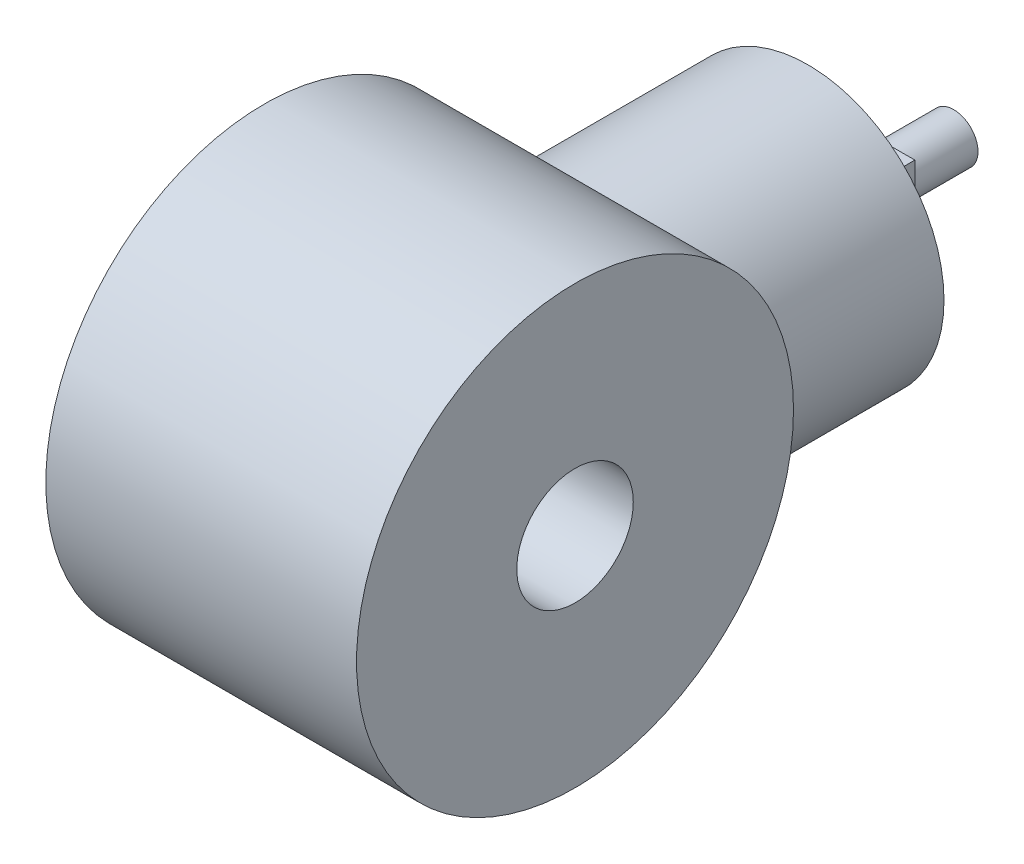
ISO-10303-21;
HEADER;
FILE_DESCRIPTION(('STEP AP214'),'2;1');
FILE_NAME('part.step','',(''),(''),'','','');
FILE_SCHEMA(('AUTOMOTIVE_DESIGN { 1 0 10303 214 1 1 1 1 }'));
ENDSEC;
DATA;
#1=APPLICATION_CONTEXT('core data for automotive mechanical design processes');
#2=APPLICATION_PROTOCOL_DEFINITION('international standard','automotive_design',2000,#1);
#3=PRODUCT_CONTEXT('',#1,'mechanical');
#4=PRODUCT('Part','Part','',(#3));
#5=PRODUCT_RELATED_PRODUCT_CATEGORY('part','',(#4));
#6=PRODUCT_DEFINITION_FORMATION('','',#4);
#7=PRODUCT_DEFINITION_CONTEXT('part definition',#1,'design');
#8=PRODUCT_DEFINITION('design','',#6,#7);
#9=PRODUCT_DEFINITION_SHAPE('','',#8);
#10=(LENGTH_UNIT() NAMED_UNIT(*) SI_UNIT(.MILLI.,.METRE.));
#11=(NAMED_UNIT(*) PLANE_ANGLE_UNIT() SI_UNIT($,.RADIAN.));
#12=(NAMED_UNIT(*) SI_UNIT($,.STERADIAN.) SOLID_ANGLE_UNIT());
#13=UNCERTAINTY_MEASURE_WITH_UNIT(LENGTH_MEASURE(1.E-05),#10,'distance_accuracy_value','');
#14=(GEOMETRIC_REPRESENTATION_CONTEXT(3) GLOBAL_UNCERTAINTY_ASSIGNED_CONTEXT((#13)) GLOBAL_UNIT_ASSIGNED_CONTEXT((#10,
#11,#12)) REPRESENTATION_CONTEXT('',''));
#15=CARTESIAN_POINT('',(0.,0.,0.));
#16=DIRECTION('',(0.,0.,1.));
#17=DIRECTION('',(1.,0.,0.));
#18=AXIS2_PLACEMENT_3D('',#15,#16,#17);
#19=CARTESIAN_POINT('',(0.,0.,-40.));
#20=DIRECTION('',(0.,0.,1.));
#21=DIRECTION('',(1.,0.,0.));
#22=AXIS2_PLACEMENT_3D('',#19,#20,#21);
#23=PLANE('',#22);
#24=CARTESIAN_POINT('',(0.,0.,-40.));
#25=DIRECTION('',(0.,0.,1.));
#26=DIRECTION('',(1.,0.,0.));
#27=AXIS2_PLACEMENT_3D('',#24,#25,#26);
#28=CIRCLE('',#27,14.);
#29=CARTESIAN_POINT('',(14.,0.,-40.));
#30=VERTEX_POINT('',#29);
#31=EDGE_CURVE('E105',#30,#30,#28,.T.);
#32=ORIENTED_EDGE('',*,*,#31,.F.);
#33=EDGE_LOOP('',(#32));
#34=FACE_BOUND('',#33,.T.);
#35=DIRECTION('',(0.,1.,0.));
#36=VECTOR('',#35,1.);
#37=CARTESIAN_POINT('',(-6.,-6.,-40.));
#38=LINE('',#37,#36);
#39=CARTESIAN_POINT('',(-6.,-6.,-40.));
#40=VERTEX_POINT('',#39);
#41=CARTESIAN_POINT('',(-6.,6.,-40.));
#42=VERTEX_POINT('',#41);
#43=EDGE_CURVE('E101',#40,#42,#38,.T.);
#44=ORIENTED_EDGE('',*,*,#43,.F.);
#45=DIRECTION('',(-1.,0.,0.));
#46=VECTOR('',#45,1.);
#47=CARTESIAN_POINT('',(6.,-6.,-40.));
#48=LINE('',#47,#46);
#49=CARTESIAN_POINT('',(6.,-6.,-40.));
#50=VERTEX_POINT('',#49);
#51=EDGE_CURVE('E98',#50,#40,#48,.T.);
#52=ORIENTED_EDGE('',*,*,#51,.F.);
#53=DIRECTION('',(0.,-1.,0.));
#54=VECTOR('',#53,1.);
#55=CARTESIAN_POINT('',(6.,-6.,-40.));
#56=LINE('',#55,#54);
#57=CARTESIAN_POINT('',(6.,6.,-40.));
#58=VERTEX_POINT('',#57);
#59=EDGE_CURVE('E60',#58,#50,#56,.T.);
#60=ORIENTED_EDGE('',*,*,#59,.F.);
#61=DIRECTION('',(1.,0.,0.));
#62=VECTOR('',#61,1.);
#63=CARTESIAN_POINT('',(6.,6.,-40.));
#64=LINE('',#63,#62);
#65=EDGE_CURVE('E55',#42,#58,#64,.T.);
#66=ORIENTED_EDGE('',*,*,#65,.F.);
#67=EDGE_LOOP('',(#44,#52,#60,#66));
#68=FACE_BOUND('',#67,.T.);
#69=ADVANCED_FACE('F39',(#34,#68),#23,.F.);
#70=CARTESIAN_POINT('',(16.,0.,0.));
#71=DIRECTION('',(1.,0.,0.));
#72=DIRECTION('',(0.,0.,-1.));
#73=AXIS2_PLACEMENT_3D('',#70,#71,#72);
#74=PLANE('',#73);
#75=CARTESIAN_POINT('',(16.,0.,0.));
#76=DIRECTION('',(1.,0.,0.));
#77=DIRECTION('',(0.,0.,-1.));
#78=AXIS2_PLACEMENT_3D('',#75,#76,#77);
#79=CIRCLE('',#78,22.5);
#80=CARTESIAN_POINT('',(16.,0.,-22.5));
#81=VERTEX_POINT('',#80);
#82=EDGE_CURVE('E48',#81,#81,#79,.T.);
#83=ORIENTED_EDGE('',*,*,#82,.T.);
#84=EDGE_LOOP('',(#83));
#85=FACE_BOUND('',#84,.T.);
#86=CARTESIAN_POINT('',(16.,0.,0.));
#87=DIRECTION('',(1.,0.,0.));
#88=DIRECTION('',(0.,0.,-1.));
#89=AXIS2_PLACEMENT_3D('',#86,#87,#88);
#90=CIRCLE('',#89,6.);
#91=CARTESIAN_POINT('',(16.,0.,-6.));
#92=VERTEX_POINT('',#91);
#93=EDGE_CURVE('E121',#92,#92,#90,.T.);
#94=ORIENTED_EDGE('',*,*,#93,.F.);
#95=EDGE_LOOP('',(#94));
#96=FACE_BOUND('',#95,.T.);
#97=ADVANCED_FACE('F134',(#85,#96),#74,.T.);
#98=CARTESIAN_POINT('',(-16.,0.,0.));
#99=DIRECTION('',(1.,0.,0.));
#100=DIRECTION('',(0.,0.,-1.));
#101=AXIS2_PLACEMENT_3D('',#98,#99,#100);
#102=PLANE('',#101);
#103=CARTESIAN_POINT('',(-16.,0.,0.));
#104=DIRECTION('',(1.,0.,0.));
#105=DIRECTION('',(0.,0.,-1.));
#106=AXIS2_PLACEMENT_3D('',#103,#104,#105);
#107=CIRCLE('',#106,22.5);
#108=CARTESIAN_POINT('',(-16.,0.,-22.5));
#109=VERTEX_POINT('',#108);
#110=EDGE_CURVE('E279',#109,#109,#107,.T.);
#111=ORIENTED_EDGE('',*,*,#110,.F.);
#112=EDGE_LOOP('',(#111));
#113=FACE_BOUND('',#112,.T.);
#114=CARTESIAN_POINT('',(-16.,0.,0.));
#115=DIRECTION('',(1.,0.,0.));
#116=DIRECTION('',(0.,0.,-1.));
#117=AXIS2_PLACEMENT_3D('',#114,#115,#116);
#118=CIRCLE('',#117,6.);
#119=CARTESIAN_POINT('',(-16.,0.,-6.));
#120=VERTEX_POINT('',#119);
#121=EDGE_CURVE('E120',#120,#120,#118,.T.);
#122=ORIENTED_EDGE('',*,*,#121,.T.);
#123=EDGE_LOOP('',(#122));
#124=FACE_BOUND('',#123,.T.);
#125=ADVANCED_FACE('F136',(#113,#124),#102,.F.);
#126=CARTESIAN_POINT('',(16.,0.,0.));
#127=DIRECTION('',(-1.,0.,0.));
#128=DIRECTION('',(0.,0.,1.));
#129=AXIS2_PLACEMENT_3D('',#126,#127,#128);
#130=CYLINDRICAL_SURFACE('',#129,22.5);
#131=ORIENTED_EDGE('',*,*,#110,.T.);
#132=EDGE_LOOP('',(#131));
#133=FACE_BOUND('',#132,.T.);
#134=CARTESIAN_POINT('',(14.,0.,-22.5));
#135=CARTESIAN_POINT('',(13.9999991063449,0.356097070760692,-22.4999990143699));
#136=CARTESIAN_POINT('',(13.9863954765435,0.712218350277575,-22.4915272958149));
#137=CARTESIAN_POINT('',(13.9321685824194,1.42174063001494,-22.4578466611244));
#138=CARTESIAN_POINT('',(13.8915331197188,1.77514032923202,-22.4326301887648));
#139=CARTESIAN_POINT('',(13.7837231030717,2.47694073666973,-22.3660283513862));
#140=CARTESIAN_POINT('',(13.7165027734724,2.82533174256533,-22.3246150990087));
#141=CARTESIAN_POINT('',(13.5564441244614,3.51394010054276,-22.2266321618331));
#142=CARTESIAN_POINT('',(13.4636083824175,3.85415827121584,-22.1700640019058));
#143=CARTESIAN_POINT('',(13.2539894629711,4.52259338441289,-22.0433958764243));
#144=CARTESIAN_POINT('',(13.1373281147551,4.85086174847136,-21.9733648543906));
#145=CARTESIAN_POINT('',(12.8810427155204,5.49536361825578,-21.8211053520407));
#146=CARTESIAN_POINT('',(12.7414181701369,5.81159686470234,-21.7388766091287));
#147=CARTESIAN_POINT('',(12.4405700102356,6.43044019166893,-21.5639238631528));
#148=CARTESIAN_POINT('',(12.2793531031596,6.73305446393551,-21.4712031207009));
#149=CARTESIAN_POINT('',(11.9365571460911,7.32360555209682,-21.2770168328875));
#150=CARTESIAN_POINT('',(11.7549755696832,7.61154054043849,-21.1755502028841));
#151=CARTESIAN_POINT('',(11.3574765199916,8.19400545558421,-20.9573974599138));
#152=CARTESIAN_POINT('',(11.1399774171205,8.48724295592487,-20.8401426208988));
#153=CARTESIAN_POINT('',(10.6840341744648,9.05449350465572,-20.600024873324));
#154=CARTESIAN_POINT('',(10.445589107087,9.32850570068461,-20.4771617165154));
#155=CARTESIAN_POINT('',(9.94862465188903,9.85680235955472,-20.2281690739126));
#156=CARTESIAN_POINT('',(9.69008020116802,10.111061375416,-20.1020356451637));
#157=CARTESIAN_POINT('',(9.1542032090265,10.5986702200811,-19.8492724340888));
#158=CARTESIAN_POINT('',(8.8768701184529,10.8320194372713,-19.722642637357));
#159=CARTESIAN_POINT('',(8.2658596247561,11.3068419436011,-19.4547996495074));
#160=CARTESIAN_POINT('',(7.92961458355073,11.545205662179,-19.3139089577244));
#161=CARTESIAN_POINT('',(7.23522428056692,11.9925865501106,-19.0393482416016));
#162=CARTESIAN_POINT('',(6.877074990088,12.2015982975125,-18.9056795541225));
#163=CARTESIAN_POINT('',(6.14073545483857,12.5882506642244,-18.6504569420656));
#164=CARTESIAN_POINT('',(5.76257305179082,12.7659334496767,-18.528886831374));
#165=CARTESIAN_POINT('',(4.98756561364782,13.0881671689531,-18.3026958276451));
#166=CARTESIAN_POINT('',(4.59072830652404,13.2327316648236,-18.1980680018518));
#167=CARTESIAN_POINT('',(3.88513918827318,13.4538110619401,-18.0349292211783));
#168=CARTESIAN_POINT('',(3.57999709901742,13.5382643592609,-17.9714792470539));
#169=CARTESIAN_POINT('',(2.96224320580907,13.6867074831745,-17.8586883245612));
#170=CARTESIAN_POINT('',(2.64963321704918,13.7507022292345,-17.8093439846518));
#171=CARTESIAN_POINT('',(2.01907360660311,13.8573251676281,-17.7265086605148));
#172=CARTESIAN_POINT('',(1.70113056156642,13.8999779261594,-17.6929994513684));
#173=CARTESIAN_POINT('',(1.06171502205683,13.9633794501665,-17.6430064881633));
#174=CARTESIAN_POINT('',(0.74024247772128,13.9841279057882,-17.6265229749471));
#175=CARTESIAN_POINT('',(0.0953808872242142,14.0034002854199,-17.6112162512838));
#176=CARTESIAN_POINT('',(-0.22801095870823,14.0018671514822,-17.6124383808281));
#177=CARTESIAN_POINT('',(-0.873354428547939,13.97646364726,-17.6326039054413));
#178=CARTESIAN_POINT('',(-1.1953060450018,13.9525931615104,-17.6515473921147));
#179=CARTESIAN_POINT('',(-1.83556301177623,13.8828847906998,-17.7064243703099));
#180=CARTESIAN_POINT('',(-2.15386570296615,13.8370318135284,-17.7423695341295));
#181=CARTESIAN_POINT('',(-2.78446216526763,13.7240443241488,-17.8299101531281));
#182=CARTESIAN_POINT('',(-3.0967558034086,13.6569093415775,-17.8815059542076));
#183=CARTESIAN_POINT('',(-3.70676991729286,13.5039464211317,-17.9972888935506));
#184=CARTESIAN_POINT('',(-4.00465984733719,13.4185620879421,-18.0611741417939));
#185=CARTESIAN_POINT('',(-4.59179982140109,13.2291560354186,-18.2003635920619));
#186=CARTESIAN_POINT('',(-4.88104701592402,13.1251282467728,-18.2756715114669));
#187=CARTESIAN_POINT('',(-5.44983142456798,12.8993400599701,-18.4357306593898));
#188=CARTESIAN_POINT('',(-5.72936822981811,12.7775789162412,-18.5204822849188));
#189=CARTESIAN_POINT('',(-6.27798380238452,12.517153681204,-18.6974771275311));
#190=CARTESIAN_POINT('',(-6.54706205932532,12.3784887663568,-18.7897207095436));
#191=CARTESIAN_POINT('',(-7.12315036574906,12.0577227084505,-18.997481055651));
#192=CARTESIAN_POINT('',(-7.42792424344296,11.8723373870692,-19.1141384855461));
#193=CARTESIAN_POINT('',(-8.02107596986107,11.4799300062105,-19.3523613239283));
#194=CARTESIAN_POINT('',(-8.30945609304615,11.2729109595519,-19.4739260475583));
#195=CARTESIAN_POINT('',(-8.86940709190691,10.8378705685859,-19.7193557781036));
#196=CARTESIAN_POINT('',(-9.14096035407191,10.6098278185812,-19.8432230246409));
#197=CARTESIAN_POINT('',(-9.66610969518611,10.1337040929321,-20.0905456910712));
#198=CARTESIAN_POINT('',(-9.9197046294846,9.88562184213811,-20.2140010842358));
#199=CARTESIAN_POINT('',(-10.4476162402387,9.3283197696847,-20.4778479284996));
#200=CARTESIAN_POINT('',(-10.7186212696107,9.01571048102724,-20.6177380925806));
#201=CARTESIAN_POINT('',(-11.2333493529561,8.36562967979878,-20.8899601598757));
#202=CARTESIAN_POINT('',(-11.4770692023033,8.02815525453592,-21.0222911743807));
#203=CARTESIAN_POINT('',(-11.9350888320568,7.3299323932841,-21.2758074096155));
#204=CARTESIAN_POINT('',(-12.1493958865148,6.96918974429673,-21.3969953836647));
#205=CARTESIAN_POINT('',(-12.5463308451294,6.22630498724362,-21.6248469618756));
#206=CARTESIAN_POINT('',(-12.7289625365012,5.84416544470126,-21.7315123020849));
#207=CARTESIAN_POINT('',(-13.0509942907445,5.08260793859719,-21.9217363589385));
#208=CARTESIAN_POINT('',(-13.1922230753291,4.70420212464339,-22.0062449689521));
#209=CARTESIAN_POINT('',(-13.442236496525,3.93324908027808,-22.1570252528652));
#210=CARTESIAN_POINT('',(-13.5510217780177,3.54070213112461,-22.2232972892522));
#211=CARTESIAN_POINT('',(-13.7342547837559,2.74528889528994,-22.3354988912287));
#212=CARTESIAN_POINT('',(-13.8087421267131,2.34243508535216,-22.3814519255366));
#213=CARTESIAN_POINT('',(-13.9221968391314,1.52990582154782,-22.4516271114232));
#214=CARTESIAN_POINT('',(-13.961170148282,1.12023152007733,-22.4758528968536));
#215=CARTESIAN_POINT('',(-13.9997998195308,0.358889373676653,-22.4998719272296));
#216=CARTESIAN_POINT('',(-14.0043982827077,0.00755774378719101,-22.5027361711104));
#217=CARTESIAN_POINT('',(-13.9871816996814,-0.69417998235557,-22.4920251896602));
#218=CARTESIAN_POINT('',(-13.9653697696335,-1.04458618291156,-22.4784519037889));
#219=CARTESIAN_POINT('',(-13.8956481416465,-1.74175208722438,-22.4352021344506));
#220=CARTESIAN_POINT('',(-13.8477399746312,-2.08851200367258,-22.4055265956152));
#221=CARTESIAN_POINT('',(-13.7264844114638,-2.77586354777609,-22.3307880770863));
#222=CARTESIAN_POINT('',(-13.653136542784,-3.11645506073326,-22.285724811575));
#223=CARTESIAN_POINT('',(-13.4851559526508,-3.77653035917098,-22.1832184234865));
#224=CARTESIAN_POINT('',(-13.3914243330754,-4.09632676495062,-22.1263027830684));
#225=CARTESIAN_POINT('',(-13.1822823440839,-4.72626431908141,-22.0003545406357));
#226=CARTESIAN_POINT('',(-13.0668728530538,-5.0364058580537,-21.931322429587));
#227=CARTESIAN_POINT('',(-12.8154741779394,-5.64554678099418,-21.782472736762));
#228=CARTESIAN_POINT('',(-12.6794843695837,-5.94454582662948,-21.7026548278234));
#229=CARTESIAN_POINT('',(-12.3880468486983,-6.5301837746921,-21.5336854587996));
#230=CARTESIAN_POINT('',(-12.2325967516374,-6.81682115660849,-21.4445328551239));
#231=CARTESIAN_POINT('',(-11.8866610539475,-7.40508045510371,-21.2490077061142));
#232=CARTESIAN_POINT('',(-11.6942214627053,-7.70527800990255,-21.1418056549229));
#233=CARTESIAN_POINT('',(-11.288463870177,-8.28835118714579,-20.9200990227065));
#234=CARTESIAN_POINT('',(-11.0751447036999,-8.57122584144697,-20.8055940342632));
#235=CARTESIAN_POINT('',(-10.628640705419,-9.11904546917578,-20.5713838782847));
#236=CARTESIAN_POINT('',(-10.3954363746239,-9.38397237592853,-20.4516736642968));
#237=CARTESIAN_POINT('',(-9.91041232281628,-9.89483745973913,-20.2094563165926));
#238=CARTESIAN_POINT('',(-9.65859116539603,-10.1407741685819,-20.0869489675645));
#239=CARTESIAN_POINT('',(-9.09978037256264,-10.646867649964,-19.8238941960109));
#240=CARTESIAN_POINT('',(-8.79006308548143,-10.9039892311197,-19.6832841834239));
#241=CARTESIAN_POINT('',(-8.14864949782422,-11.3913021109329,-19.4053328807151));
#242=CARTESIAN_POINT('',(-7.81694950469237,-11.621488867149,-19.2679921450446));
#243=CARTESIAN_POINT('',(-7.13300281471241,-12.0533696487139,-19.0008081273582));
#244=CARTESIAN_POINT('',(-6.78077239104192,-12.25508581837,-18.8709590653482));
#245=CARTESIAN_POINT('',(-6.05666117524255,-12.6286498218822,-18.623036461906));
#246=CARTESIAN_POINT('',(-5.68477664643218,-12.8004919491879,-18.5049651721));
#247=CARTESIAN_POINT('',(-5.0034855779446,-13.0793953783023,-18.308524713068));
#248=CARTESIAN_POINT('',(-4.69743443018148,-13.1924763545354,-18.2270330766376));
#249=CARTESIAN_POINT('',(-4.07550371447287,-13.3976638555018,-18.076746941565));
#250=CARTESIAN_POINT('',(-3.75963018923896,-13.489782996707,-18.0079448101369));
#251=CARTESIAN_POINT('',(-3.11976359885008,-13.6519549960383,-17.8853144274028));
#252=CARTESIAN_POINT('',(-2.79577966995472,-13.7220315751265,-17.8314700867102));
#253=CARTESIAN_POINT('',(-2.14132899837133,-13.8392629880396,-17.7406403655119));
#254=CARTESIAN_POINT('',(-1.8108622695535,-13.8864178709009,-17.7036549489399));
#255=CARTESIAN_POINT('',(-1.14399970642003,-13.9572312071607,-17.6478825891211));
#256=CARTESIAN_POINT('',(-0.807581108722389,-13.9807574190091,-17.6291980840485));
#257=CARTESIAN_POINT('',(-0.133399167373299,-14.0034266162649,-17.6111969753959));
#258=CARTESIAN_POINT('',(0.204364171637468,-14.0025696857454,-17.6118803050355));
#259=CARTESIAN_POINT('',(0.878453554406333,-13.9764850836819,-17.6325872637024));
#260=CARTESIAN_POINT('',(1.21477908673595,-13.9512493649163,-17.6526172788985));
#261=CARTESIAN_POINT('',(1.88312198541007,-13.8768481077348,-17.7111635018145));
#262=CARTESIAN_POINT('',(2.21513940191667,-13.8276828482026,-17.749679494092));
#263=CARTESIAN_POINT('',(2.847096430935,-13.7109159899639,-17.8400046209491));
#264=CARTESIAN_POINT('',(3.14753630822845,-13.6450271196387,-17.8905606177838));
#265=CARTESIAN_POINT('',(3.74122938906233,-13.4943337274358,-18.0044960451393));
#266=CARTESIAN_POINT('',(4.03448025553805,-13.4095231425079,-18.0678795853599));
#267=CARTESIAN_POINT('',(4.61251008112275,-13.221841038016,-18.2056705838513));
#268=CARTESIAN_POINT('',(4.89728822823095,-13.1189677938579,-18.2800790946628));
#269=CARTESIAN_POINT('',(5.45734443068171,-12.8960582969548,-18.4380147760727));
#270=CARTESIAN_POINT('',(5.73262212749024,-12.7760213973541,-18.5215422903159));
#271=CARTESIAN_POINT('',(6.62221127308823,-12.3537800104942,-18.8085087023368));
#272=CARTESIAN_POINT('',(7.21544987836899,-12.0164484645334,-19.0275484110721));
#273=CARTESIAN_POINT('',(8.06010022417248,-11.4520694849974,-19.3687576085944));
#274=CARTESIAN_POINT('',(8.3342878987445,-11.2540573187376,-19.4846859677146));
#275=CARTESIAN_POINT('',(8.8672219656207,-10.8391103665342,-19.7185274416532));
#276=CARTESIAN_POINT('',(9.12596723722914,-10.6221742100325,-19.8364406997267));
#277=CARTESIAN_POINT('',(9.67595262090818,-10.1261301722912,-20.0948793656167));
#278=CARTESIAN_POINT('',(9.96372478000989,-9.84313657480139,-20.2353422163846));
#279=CARTESIAN_POINT('',(10.514689399335,-9.25227001166964,-20.5122398874249));
#280=CARTESIAN_POINT('',(10.777878683044,-8.94439384034817,-20.6486741855883));
#281=CARTESIAN_POINT('',(11.2781830421511,-8.30466819647365,-20.9141680993678));
#282=CARTESIAN_POINT('',(11.5152802518571,-7.97280255237931,-21.0432226332422));
#283=CARTESIAN_POINT('',(11.8496380531149,-7.45841218343327,-21.2286445071225));
#284=CARTESIAN_POINT('',(11.9575416277361,-7.28418533088141,-21.2890912173789));
#285=CARTESIAN_POINT('',(12.1660574077229,-6.93031323868878,-21.4069042672453));
#286=CARTESIAN_POINT('',(12.2666668861796,-6.75066600781436,-21.4642694527674));
#287=CARTESIAN_POINT('',(12.5566431024792,-6.20485018192081,-21.6308630806129));
#288=CARTESIAN_POINT('',(12.7347014185717,-5.83097261813776,-21.734893555375));
#289=CARTESIAN_POINT('',(13.0581919714671,-5.06520334425359,-21.9259968322529));
#290=CARTESIAN_POINT('',(13.2036300302365,-4.67331486375515,-22.0130726600171));
#291=CARTESIAN_POINT('',(13.3954748988431,-4.07492554203531,-22.1288541727767));
#292=CARTESIAN_POINT('',(13.4549795158029,-3.87396203641952,-22.1649399126865));
#293=CARTESIAN_POINT('',(13.5650774576718,-3.4688249782404,-22.2319460011667));
#294=CARTESIAN_POINT('',(13.6156730985371,-3.26465227501011,-22.2628676920629));
#295=CARTESIAN_POINT('',(13.7536968188771,-2.64818147624363,-22.3474561898602));
#296=CARTESIAN_POINT('',(13.8274827573131,-2.23155423681448,-22.3930199664094));
#297=CARTESIAN_POINT('',(13.9213973375204,-1.51200587963175,-22.4511563186984));
#298=CARTESIAN_POINT('',(13.9508414460303,-1.2106965137664,-22.4694403922936));
#299=CARTESIAN_POINT('',(13.9901437623131,-0.606264020431728,-22.493863027433));
#300=CARTESIAN_POINT('',(14.0000007607569,-0.303140782130812,-22.500000839054));
#301=CARTESIAN_POINT('',(14.,0.,-22.5));
#302=B_SPLINE_CURVE_WITH_KNOTS('',3,(#134,#135,#136,#137,#138,#139,#140,#141,#142,#143,#144,
#145,#146,#147,#148,#149,#150,#151,#152,#153,#154,#155,#156,#157,#158,#159,#160,#161,#162,#163,
#164,#165,#166,#167,#168,#169,#170,#171,#172,#173,#174,#175,#176,#177,#178,#179,#180,#181,#182,
#183,#184,#185,#186,#187,#188,#189,#190,#191,#192,#193,#194,#195,#196,#197,#198,#199,#200,#201,
#202,#203,#204,#205,#206,#207,#208,#209,#210,#211,#212,#213,#214,#215,#216,#217,#218,#219,#220,
#221,#222,#223,#224,#225,#226,#227,#228,#229,#230,#231,#232,#233,#234,#235,#236,#237,#238,#239,
#240,#241,#242,#243,#244,#245,#246,#247,#248,#249,#250,#251,#252,#253,#254,#255,#256,#257,#258,
#259,#260,#261,#262,#263,#264,#265,#266,#267,#268,#269,#270,#271,#272,#273,#274,#275,#276,#277,
#278,#279,#280,#281,#282,#283,#284,#285,#286,#287,#288,#289,#290,#291,#292,#293,#294,#295,#296,
#297,#298,#299,#300,#301),.UNSPECIFIED.,.T.,.F.,(4,2,2,2,2,2,2,2,2,2,2,2,2,2,2,2,2,2,2,2,2,2,2,
2,2,2,2,2,2,2,2,2,2,2,2,2,2,2,2,2,2,2,2,2,2,2,2,2,2,2,2,2,2,2,2,2,2,2,2,2,2,2,2,2,2,2,2,2,2,2,2,
2,2,2,2,2,2,2,2,2,2,2,2,4),(0.,1.0679758240011,2.13643390971613,3.20673980634869,
4.27693805034709,5.34179515043565,6.40667517837594,7.47122517637423,8.53590738751166,
9.68514764063392,10.8344388136121,11.9851868179432,13.1359684707804,14.4411277016062,
15.7465277076779,17.050157116286,18.3532517263712,19.3210355800973,20.2885865449823,
21.2550212106111,22.2214695470601,23.1903931671192,24.1593217957176,25.1289165983471,
26.0985328319181,27.0468234955661,27.9954234345664,28.9440632675324,29.8927493359957,
31.0176229184045,32.1423400536389,33.2682152625584,34.3941621694695,35.7027545883913,
37.0115005397421,38.319922240839,39.6281873945368,40.8643030963197,42.1003942261178,
43.3350539008242,44.5695070419136,45.6222879649376,46.6749446827224,47.7275396535305,
48.7801541767215,49.7933045186599,50.8064138166712,51.8195538519125,52.8328181521628,
53.9487475505038,55.0647392591575,56.1818381561973,57.299023334728,58.576749957317,
59.8546917533394,61.1316340282376,62.4088199577247,63.4167689572916,64.4241096801529,
65.4303626213413,66.4366134098462,67.4484649713284,68.46031304395,69.472495232805,
70.4846656255925,71.4188354910979,72.3533051219358,73.2878640230142,74.222458154589,
76.3635260888552,77.4355285185538,78.5076086519192,79.7882052430145,81.0689670801281,
82.3506004909615,82.9914037086746,83.6324452693032,84.9114151721034,86.1901566261963,
86.8279270975521,87.465531530065,88.7395392601873,89.648636993739,90.55779085421),.UNSPECIFIED.);
#303=CARTESIAN_POINT('',(14.,0.,-22.5));
#304=VERTEX_POINT('',#303);
#305=EDGE_CURVE('E113',#304,#304,#302,.T.);
#306=ORIENTED_EDGE('',*,*,#305,.T.);
#307=EDGE_LOOP('',(#306));
#308=FACE_BOUND('',#307,.T.);
#309=ORIENTED_EDGE('',*,*,#82,.F.);
#310=EDGE_LOOP('',(#309));
#311=FACE_BOUND('',#310,.T.);
#312=ADVANCED_FACE('F41',(#133,#308,#311),#130,.T.);
#313=CARTESIAN_POINT('',(16.,0.,0.));
#314=DIRECTION('',(-1.,0.,0.));
#315=DIRECTION('',(0.,0.,1.));
#316=AXIS2_PLACEMENT_3D('',#313,#314,#315);
#317=CYLINDRICAL_SURFACE('',#316,6.);
#318=ORIENTED_EDGE('',*,*,#93,.T.);
#319=EDGE_LOOP('',(#318));
#320=FACE_BOUND('',#319,.T.);
#321=ORIENTED_EDGE('',*,*,#121,.F.);
#322=EDGE_LOOP('',(#321));
#323=FACE_BOUND('',#322,.T.);
#324=ADVANCED_FACE('F128',(#320,#323),#317,.F.);
#325=CARTESIAN_POINT('',(0.,0.,-40.));
#326=DIRECTION('',(0.,0.,1.));
#327=DIRECTION('',(1.,0.,0.));
#328=AXIS2_PLACEMENT_3D('',#325,#326,#327);
#329=CYLINDRICAL_SURFACE('',#328,14.);
#330=ORIENTED_EDGE('',*,*,#31,.T.);
#331=EDGE_LOOP('',(#330));
#332=FACE_BOUND('',#331,.T.);
#333=ORIENTED_EDGE('',*,*,#305,.F.);
#334=EDGE_LOOP('',(#333));
#335=FACE_BOUND('',#334,.T.);
#336=ADVANCED_FACE('F123',(#332,#335),#329,.T.);
#337=CARTESIAN_POINT('',(-6.,-6.,-45.));
#338=DIRECTION('',(1.,0.,0.));
#339=DIRECTION('',(0.,0.,-1.));
#340=AXIS2_PLACEMENT_3D('',#337,#338,#339);
#341=PLANE('',#340);
#342=ORIENTED_EDGE('',*,*,#43,.T.);
#343=DIRECTION('',(0.,0.,1.));
#344=VECTOR('',#343,1.);
#345=CARTESIAN_POINT('',(-6.,6.,-45.));
#346=LINE('',#345,#344);
#347=CARTESIAN_POINT('',(-6.,6.,-45.));
#348=VERTEX_POINT('',#347);
#349=EDGE_CURVE('E82',#348,#42,#346,.T.);
#350=ORIENTED_EDGE('',*,*,#349,.F.);
#351=DIRECTION('',(0.,1.,0.));
#352=VECTOR('',#351,1.);
#353=CARTESIAN_POINT('',(-6.,-6.,-45.));
#354=LINE('',#353,#352);
#355=CARTESIAN_POINT('',(-6.,-6.,-45.));
#356=VERTEX_POINT('',#355);
#357=EDGE_CURVE('E89',#356,#348,#354,.T.);
#358=ORIENTED_EDGE('',*,*,#357,.F.);
#359=DIRECTION('',(0.,0.,1.));
#360=VECTOR('',#359,1.);
#361=CARTESIAN_POINT('',(-6.,-6.,-45.));
#362=LINE('',#361,#360);
#363=EDGE_CURVE('E158',#356,#40,#362,.T.);
#364=ORIENTED_EDGE('',*,*,#363,.T.);
#365=EDGE_LOOP('',(#342,#350,#358,#364));
#366=FACE_BOUND('',#365,.T.);
#367=ADVANCED_FACE('F100',(#366),#341,.F.);
#368=CARTESIAN_POINT('',(6.,6.,-45.));
#369=DIRECTION('',(0.,-1.,0.));
#370=DIRECTION('',(0.,0.,-1.));
#371=AXIS2_PLACEMENT_3D('',#368,#369,#370);
#372=PLANE('',#371);
#373=ORIENTED_EDGE('',*,*,#65,.T.);
#374=DIRECTION('',(0.,0.,1.));
#375=VECTOR('',#374,1.);
#376=CARTESIAN_POINT('',(6.,6.,-45.));
#377=LINE('',#376,#375);
#378=CARTESIAN_POINT('',(6.,6.,-45.));
#379=VERTEX_POINT('',#378);
#380=EDGE_CURVE('E85',#379,#58,#377,.T.);
#381=ORIENTED_EDGE('',*,*,#380,.F.);
#382=DIRECTION('',(1.,0.,0.));
#383=VECTOR('',#382,1.);
#384=CARTESIAN_POINT('',(6.,6.,-45.));
#385=LINE('',#384,#383);
#386=EDGE_CURVE('E78',#348,#379,#385,.T.);
#387=ORIENTED_EDGE('',*,*,#386,.F.);
#388=ORIENTED_EDGE('',*,*,#349,.T.);
#389=EDGE_LOOP('',(#373,#381,#387,#388));
#390=FACE_BOUND('',#389,.T.);
#391=ADVANCED_FACE('F80',(#390),#372,.F.);
#392=CARTESIAN_POINT('',(6.,-6.,-45.));
#393=DIRECTION('',(-1.,0.,0.));
#394=DIRECTION('',(0.,0.,1.));
#395=AXIS2_PLACEMENT_3D('',#392,#393,#394);
#396=PLANE('',#395);
#397=ORIENTED_EDGE('',*,*,#59,.T.);
#398=DIRECTION('',(0.,0.,1.));
#399=VECTOR('',#398,1.);
#400=CARTESIAN_POINT('',(6.,-6.,-45.));
#401=LINE('',#400,#399);
#402=CARTESIAN_POINT('',(6.,-6.,-45.));
#403=VERTEX_POINT('',#402);
#404=EDGE_CURVE('E107',#403,#50,#401,.T.);
#405=ORIENTED_EDGE('',*,*,#404,.F.);
#406=DIRECTION('',(0.,-1.,0.));
#407=VECTOR('',#406,1.);
#408=CARTESIAN_POINT('',(6.,-6.,-45.));
#409=LINE('',#408,#407);
#410=EDGE_CURVE('E88',#379,#403,#409,.T.);
#411=ORIENTED_EDGE('',*,*,#410,.F.);
#412=ORIENTED_EDGE('',*,*,#380,.T.);
#413=EDGE_LOOP('',(#397,#405,#411,#412));
#414=FACE_BOUND('',#413,.T.);
#415=ADVANCED_FACE('F167',(#414),#396,.F.);
#416=CARTESIAN_POINT('',(6.,-6.,-45.));
#417=DIRECTION('',(0.,1.,0.));
#418=DIRECTION('',(0.,0.,1.));
#419=AXIS2_PLACEMENT_3D('',#416,#417,#418);
#420=PLANE('',#419);
#421=ORIENTED_EDGE('',*,*,#51,.T.);
#422=ORIENTED_EDGE('',*,*,#363,.F.);
#423=DIRECTION('',(-1.,0.,0.));
#424=VECTOR('',#423,1.);
#425=CARTESIAN_POINT('',(6.,-6.,-45.));
#426=LINE('',#425,#424);
#427=EDGE_CURVE('E94',#403,#356,#426,.T.);
#428=ORIENTED_EDGE('',*,*,#427,.F.);
#429=ORIENTED_EDGE('',*,*,#404,.T.);
#430=EDGE_LOOP('',(#421,#422,#428,#429));
#431=FACE_BOUND('',#430,.T.);
#432=ADVANCED_FACE('F157',(#431),#420,.F.);
#433=CARTESIAN_POINT('',(0.,0.,-45.));
#434=DIRECTION('',(0.,0.,1.));
#435=DIRECTION('',(1.,0.,0.));
#436=AXIS2_PLACEMENT_3D('',#433,#434,#435);
#437=PLANE('',#436);
#438=CARTESIAN_POINT('',(0.,0.,-45.));
#439=DIRECTION('',(0.,0.,1.));
#440=DIRECTION('',(1.,0.,0.));
#441=AXIS2_PLACEMENT_3D('',#438,#439,#440);
#442=CIRCLE('',#441,2.5);
#443=CARTESIAN_POINT('',(2.5,0.,-45.));
#444=VERTEX_POINT('',#443);
#445=EDGE_CURVE('E11',#444,#444,#442,.T.);
#446=ORIENTED_EDGE('',*,*,#445,.T.);
#447=EDGE_LOOP('',(#446));
#448=FACE_BOUND('',#447,.T.);
#449=ORIENTED_EDGE('',*,*,#357,.T.);
#450=ORIENTED_EDGE('',*,*,#386,.T.);
#451=ORIENTED_EDGE('',*,*,#410,.T.);
#452=ORIENTED_EDGE('',*,*,#427,.T.);
#453=EDGE_LOOP('',(#449,#450,#451,#452));
#454=FACE_BOUND('',#453,.T.);
#455=ADVANCED_FACE('F92',(#448,#454),#437,.F.);
#456=CARTESIAN_POINT('',(0.,0.,-55.));
#457=DIRECTION('',(0.,0.,-1.));
#458=DIRECTION('',(-1.,0.,0.));
#459=AXIS2_PLACEMENT_3D('',#456,#457,#458);
#460=PLANE('',#459);
#461=CARTESIAN_POINT('',(0.,0.,-55.));
#462=DIRECTION('',(0.,0.,-1.));
#463=DIRECTION('',(-1.,0.,0.));
#464=AXIS2_PLACEMENT_3D('',#461,#462,#463);
#465=CIRCLE('',#464,2.5);
#466=CARTESIAN_POINT('',(-2.5,0.,-55.));
#467=VERTEX_POINT('',#466);
#468=EDGE_CURVE('E102',#467,#467,#465,.T.);
#469=ORIENTED_EDGE('',*,*,#468,.T.);
#470=EDGE_LOOP('',(#469));
#471=FACE_BOUND('',#470,.T.);
#472=ADVANCED_FACE('F179',(#471),#460,.T.);
#473=CARTESIAN_POINT('',(0.,0.,-55.));
#474=DIRECTION('',(0.,0.,1.));
#475=DIRECTION('',(1.,0.,0.));
#476=AXIS2_PLACEMENT_3D('',#473,#474,#475);
#477=CYLINDRICAL_SURFACE('',#476,2.5);
#478=ORIENTED_EDGE('',*,*,#468,.F.);
#479=EDGE_LOOP('',(#478));
#480=FACE_BOUND('',#479,.T.);
#481=ORIENTED_EDGE('',*,*,#445,.F.);
#482=EDGE_LOOP('',(#481));
#483=FACE_BOUND('',#482,.T.);
#484=ADVANCED_FACE('F181',(#480,#483),#477,.T.);
#485=CLOSED_SHELL('',(#69,#97,#125,#312,#324,#336,#367,#391,#415,#432,#455,#472,#484));
#486=MANIFOLD_SOLID_BREP('B2',#485);
#487=ADVANCED_BREP_SHAPE_REPRESENTATION('',(#18,#486),#14);
#488=SHAPE_DEFINITION_REPRESENTATION(#9,#487);
ENDSEC;
END-ISO-10303-21;
